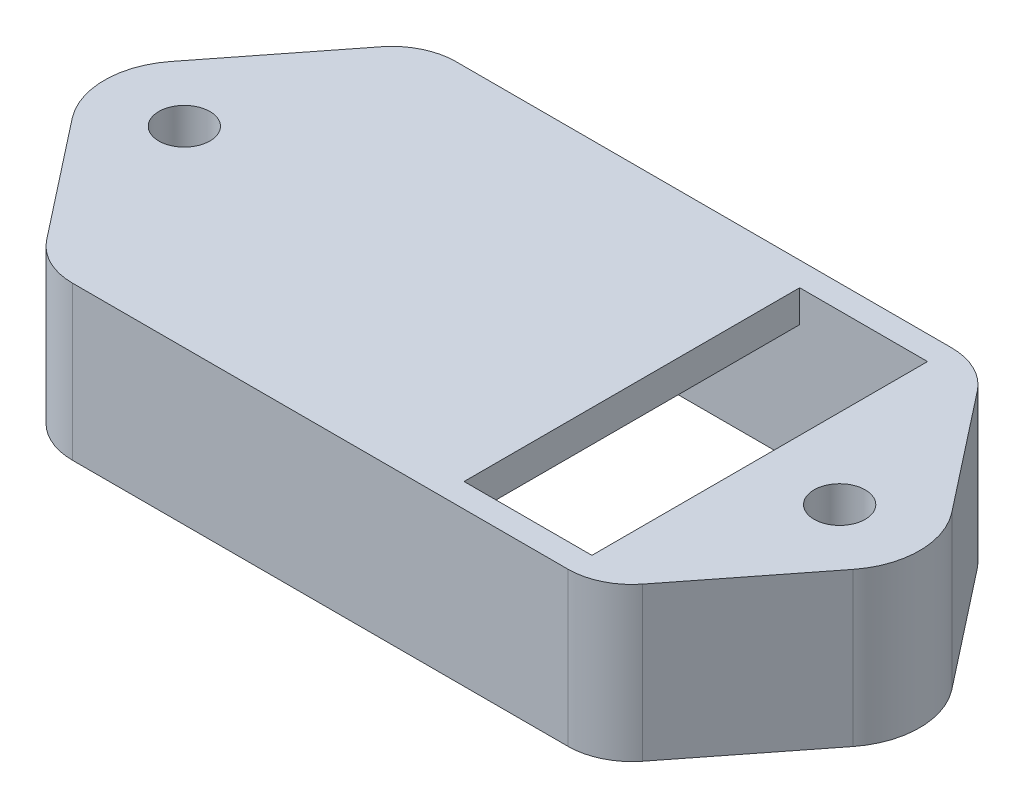
ISO-10303-21;
HEADER;
FILE_DESCRIPTION(('STEP AP214'),'2;1');
FILE_NAME('part.step','',(''),(''),'','','');
FILE_SCHEMA(('AUTOMOTIVE_DESIGN { 1 0 10303 214 1 1 1 1 }'));
ENDSEC;
DATA;
#1=APPLICATION_CONTEXT('core data for automotive mechanical design processes');
#2=APPLICATION_PROTOCOL_DEFINITION('international standard','automotive_design',2000,#1);
#3=PRODUCT_CONTEXT('',#1,'mechanical');
#4=PRODUCT('Part','Part','',(#3));
#5=PRODUCT_RELATED_PRODUCT_CATEGORY('part','',(#4));
#6=PRODUCT_DEFINITION_FORMATION('','',#4);
#7=PRODUCT_DEFINITION_CONTEXT('part definition',#1,'design');
#8=PRODUCT_DEFINITION('design','',#6,#7);
#9=PRODUCT_DEFINITION_SHAPE('','',#8);
#10=(LENGTH_UNIT() NAMED_UNIT(*) SI_UNIT(.MILLI.,.METRE.));
#11=(NAMED_UNIT(*) PLANE_ANGLE_UNIT() SI_UNIT($,.RADIAN.));
#12=(NAMED_UNIT(*) SI_UNIT($,.STERADIAN.) SOLID_ANGLE_UNIT());
#13=UNCERTAINTY_MEASURE_WITH_UNIT(LENGTH_MEASURE(1.E-05),#10,'distance_accuracy_value','');
#14=(GEOMETRIC_REPRESENTATION_CONTEXT(3) GLOBAL_UNCERTAINTY_ASSIGNED_CONTEXT((#13)) GLOBAL_UNIT_ASSIGNED_CONTEXT((#10,
#11,#12)) REPRESENTATION_CONTEXT('',''));
#15=CARTESIAN_POINT('',(0.,0.,0.));
#16=DIRECTION('',(0.,0.,1.));
#17=DIRECTION('',(1.,0.,0.));
#18=AXIS2_PLACEMENT_3D('',#15,#16,#17);
#19=CARTESIAN_POINT('',(-7.75,0.,-4.));
#20=DIRECTION('',(0.,1.,0.));
#21=DIRECTION('',(0.,0.,1.));
#22=AXIS2_PLACEMENT_3D('',#19,#20,#21);
#23=PLANE('',#22);
#24=CARTESIAN_POINT('',(-7.75,0.,-4.));
#25=DIRECTION('',(0.,1.,0.));
#26=DIRECTION('',(0.,0.,1.));
#27=AXIS2_PLACEMENT_3D('',#24,#25,#26);
#28=CIRCLE('',#27,2.);
#29=CARTESIAN_POINT('',(-7.75,0.,-6.));
#30=VERTEX_POINT('',#29);
#31=CARTESIAN_POINT('',(-9.32408207094775,0.,-5.23380129434234));
#32=VERTEX_POINT('',#31);
#33=EDGE_CURVE('E267',#30,#32,#28,.T.);
#34=ORIENTED_EDGE('',*,*,#33,.F.);
#35=DIRECTION('',(-1.,0.,0.));
#36=VECTOR('',#35,1.);
#37=CARTESIAN_POINT('',(-7.75,0.,-6.));
#38=LINE('',#37,#36);
#39=CARTESIAN_POINT('',(7.75,0.,-6.));
#40=VERTEX_POINT('',#39);
#41=EDGE_CURVE('E60',#40,#30,#38,.T.);
#42=ORIENTED_EDGE('',*,*,#41,.F.);
#43=CARTESIAN_POINT('',(7.75,0.,-4.));
#44=DIRECTION('',(0.,1.,0.));
#45=DIRECTION('',(0.,0.,-1.));
#46=AXIS2_PLACEMENT_3D('',#43,#44,#45);
#47=CIRCLE('',#46,2.);
#48=CARTESIAN_POINT('',(9.32408207094775,0.,-5.23380129434234));
#49=VERTEX_POINT('',#48);
#50=EDGE_CURVE('E288',#49,#40,#47,.T.);
#51=ORIENTED_EDGE('',*,*,#50,.F.);
#52=DIRECTION('',(-0.616900647171171,0.,-0.787041035473875));
#53=VECTOR('',#52,1.);
#54=CARTESIAN_POINT('',(9.32408207094775,0.,-5.23380129434234));
#55=LINE('',#54,#53);
#56=CARTESIAN_POINT('',(12.2176025886847,0.,-1.54225161792793));
#57=VERTEX_POINT('',#56);
#58=EDGE_CURVE('E286',#57,#49,#55,.T.);
#59=ORIENTED_EDGE('',*,*,#58,.F.);
#60=CARTESIAN_POINT('',(10.25,0.,0.));
#61=DIRECTION('',(0.,1.,0.));
#62=DIRECTION('',(0.,0.,-1.));
#63=AXIS2_PLACEMENT_3D('',#60,#61,#62);
#64=CIRCLE('',#63,2.49999999999999);
#65=CARTESIAN_POINT('',(12.2176025886847,0.,1.54225161792793));
#66=VERTEX_POINT('',#65);
#67=EDGE_CURVE('E284',#66,#57,#64,.T.);
#68=ORIENTED_EDGE('',*,*,#67,.F.);
#69=DIRECTION('',(0.616900647171171,0.,-0.787041035473875));
#70=VECTOR('',#69,1.);
#71=CARTESIAN_POINT('',(9.32408207094775,0.,5.23380129434234));
#72=LINE('',#71,#70);
#73=CARTESIAN_POINT('',(9.32408207094775,0.,5.23380129434234));
#74=VERTEX_POINT('',#73);
#75=EDGE_CURVE('E282',#74,#66,#72,.T.);
#76=ORIENTED_EDGE('',*,*,#75,.F.);
#77=CARTESIAN_POINT('',(7.75,0.,4.));
#78=DIRECTION('',(0.,1.,0.));
#79=DIRECTION('',(0.,0.,1.));
#80=AXIS2_PLACEMENT_3D('',#77,#78,#79);
#81=CIRCLE('',#80,2.);
#82=CARTESIAN_POINT('',(7.75,0.,6.));
#83=VERTEX_POINT('',#82);
#84=EDGE_CURVE('E280',#83,#74,#81,.T.);
#85=ORIENTED_EDGE('',*,*,#84,.F.);
#86=DIRECTION('',(1.,0.,0.));
#87=VECTOR('',#86,1.);
#88=CARTESIAN_POINT('',(-7.75,0.,6.));
#89=LINE('',#88,#87);
#90=CARTESIAN_POINT('',(-7.75,0.,6.));
#91=VERTEX_POINT('',#90);
#92=EDGE_CURVE('E278',#91,#83,#89,.T.);
#93=ORIENTED_EDGE('',*,*,#92,.F.);
#94=CARTESIAN_POINT('',(-7.75,0.,4.));
#95=DIRECTION('',(0.,1.,0.));
#96=DIRECTION('',(0.,0.,-1.));
#97=AXIS2_PLACEMENT_3D('',#94,#95,#96);
#98=CIRCLE('',#97,2.);
#99=CARTESIAN_POINT('',(-9.32408207094775,0.,5.23380129434234));
#100=VERTEX_POINT('',#99);
#101=EDGE_CURVE('E276',#100,#91,#98,.T.);
#102=ORIENTED_EDGE('',*,*,#101,.F.);
#103=DIRECTION('',(0.616900647171171,0.,0.787041035473875));
#104=VECTOR('',#103,1.);
#105=CARTESIAN_POINT('',(-9.32408207094775,0.,5.23380129434234));
#106=LINE('',#105,#104);
#107=CARTESIAN_POINT('',(-12.2176025886847,0.,1.54225161792793));
#108=VERTEX_POINT('',#107);
#109=EDGE_CURVE('E274',#108,#100,#106,.T.);
#110=ORIENTED_EDGE('',*,*,#109,.F.);
#111=CARTESIAN_POINT('',(-10.25,0.,0.));
#112=DIRECTION('',(0.,1.,0.));
#113=DIRECTION('',(0.,0.,1.));
#114=AXIS2_PLACEMENT_3D('',#111,#112,#113);
#115=CIRCLE('',#114,2.49999999999999);
#116=CARTESIAN_POINT('',(-12.2176025886847,0.,-1.54225161792793));
#117=VERTEX_POINT('',#116);
#118=EDGE_CURVE('E272',#117,#108,#115,.T.);
#119=ORIENTED_EDGE('',*,*,#118,.F.);
#120=DIRECTION('',(-0.616900647171171,0.,0.787041035473875));
#121=VECTOR('',#120,1.);
#122=CARTESIAN_POINT('',(-9.32408207094775,0.,-5.23380129434234));
#123=LINE('',#122,#121);
#124=EDGE_CURVE('E270',#32,#117,#123,.T.);
#125=ORIENTED_EDGE('',*,*,#124,.F.);
#126=EDGE_LOOP('',(#34,#42,#51,#59,#68,#76,#85,#93,#102,#110,#119,#125));
#127=FACE_BOUND('',#126,.T.);
#128=DIRECTION('',(0.,0.,1.));
#129=VECTOR('',#128,1.);
#130=CARTESIAN_POINT('',(-7.75,0.,5.25));
#131=LINE('',#130,#129);
#132=CARTESIAN_POINT('',(-7.75,0.,-5.25));
#133=VERTEX_POINT('',#132);
#134=CARTESIAN_POINT('',(-7.75,0.,5.25));
#135=VERTEX_POINT('',#134);
#136=EDGE_CURVE('E52',#133,#135,#131,.T.);
#137=ORIENTED_EDGE('',*,*,#136,.T.);
#138=DIRECTION('',(1.,0.,0.));
#139=VECTOR('',#138,1.);
#140=CARTESIAN_POINT('',(-7.75,0.,5.25));
#141=LINE('',#140,#139);
#142=CARTESIAN_POINT('',(7.75,0.,5.25));
#143=VERTEX_POINT('',#142);
#144=EDGE_CURVE('E252',#135,#143,#141,.T.);
#145=ORIENTED_EDGE('',*,*,#144,.T.);
#146=DIRECTION('',(0.,0.,-1.));
#147=VECTOR('',#146,1.);
#148=CARTESIAN_POINT('',(7.75,0.,5.25));
#149=LINE('',#148,#147);
#150=CARTESIAN_POINT('',(7.75,0.,-5.25));
#151=VERTEX_POINT('',#150);
#152=EDGE_CURVE('E255',#143,#151,#149,.T.);
#153=ORIENTED_EDGE('',*,*,#152,.T.);
#154=DIRECTION('',(-1.,0.,0.));
#155=VECTOR('',#154,1.);
#156=CARTESIAN_POINT('',(-7.75,0.,-5.25));
#157=LINE('',#156,#155);
#158=EDGE_CURVE('E245',#151,#133,#157,.T.);
#159=ORIENTED_EDGE('',*,*,#158,.T.);
#160=EDGE_LOOP('',(#137,#145,#153,#159));
#161=FACE_BOUND('',#160,.T.);
#162=CARTESIAN_POINT('',(-10.25,0.,0.));
#163=DIRECTION('',(0.,1.,0.));
#164=DIRECTION('',(0.,0.,-1.));
#165=AXIS2_PLACEMENT_3D('',#162,#163,#164);
#166=CIRCLE('',#165,0.800000000000001);
#167=CARTESIAN_POINT('',(-10.25,0.,-0.800000000000001));
#168=VERTEX_POINT('',#167);
#169=EDGE_CURVE('E239',#168,#168,#166,.T.);
#170=ORIENTED_EDGE('',*,*,#169,.T.);
#171=EDGE_LOOP('',(#170));
#172=FACE_BOUND('',#171,.T.);
#173=CARTESIAN_POINT('',(10.25,0.,0.));
#174=DIRECTION('',(0.,1.,0.));
#175=DIRECTION('',(0.,0.,1.));
#176=AXIS2_PLACEMENT_3D('',#173,#174,#175);
#177=CIRCLE('',#176,0.800000000000001);
#178=CARTESIAN_POINT('',(10.25,0.,0.800000000000001));
#179=VERTEX_POINT('',#178);
#180=EDGE_CURVE('E236',#179,#179,#177,.T.);
#181=ORIENTED_EDGE('',*,*,#180,.T.);
#182=EDGE_LOOP('',(#181));
#183=FACE_BOUND('',#182,.T.);
#184=ADVANCED_FACE('F37',(#127,#161,#172,#183),#23,.F.);
#185=CARTESIAN_POINT('',(-7.75,3.8,-4.));
#186=DIRECTION('',(0.,-1.,0.));
#187=DIRECTION('',(0.,0.,-1.));
#188=AXIS2_PLACEMENT_3D('',#185,#186,#187);
#189=CYLINDRICAL_SURFACE('',#188,2.);
#190=ORIENTED_EDGE('',*,*,#33,.T.);
#191=DIRECTION('',(0.,-1.,0.));
#192=VECTOR('',#191,1.);
#193=CARTESIAN_POINT('',(-9.32408207094775,3.8,-5.23380129434234));
#194=LINE('',#193,#192);
#195=CARTESIAN_POINT('',(-9.32408207094775,4.8,-5.23380129434234));
#196=VERTEX_POINT('',#195);
#197=EDGE_CURVE('E11',#196,#32,#194,.T.);
#198=ORIENTED_EDGE('',*,*,#197,.F.);
#199=CARTESIAN_POINT('',(-7.75,4.8,-4.));
#200=DIRECTION('',(0.,1.,0.));
#201=DIRECTION('',(0.,0.,1.));
#202=AXIS2_PLACEMENT_3D('',#199,#200,#201);
#203=CIRCLE('',#202,2.);
#204=CARTESIAN_POINT('',(-7.75,4.8,-6.));
#205=VERTEX_POINT('',#204);
#206=EDGE_CURVE('E186',#205,#196,#203,.T.);
#207=ORIENTED_EDGE('',*,*,#206,.F.);
#208=DIRECTION('',(0.,-1.,0.));
#209=VECTOR('',#208,1.);
#210=CARTESIAN_POINT('',(-7.75,3.8,-6.));
#211=LINE('',#210,#209);
#212=EDGE_CURVE('E291',#205,#30,#211,.T.);
#213=ORIENTED_EDGE('',*,*,#212,.T.);
#214=EDGE_LOOP('',(#190,#198,#207,#213));
#215=FACE_BOUND('',#214,.T.);
#216=ADVANCED_FACE('F39',(#215),#189,.T.);
#217=CARTESIAN_POINT('',(-9.32408207094775,3.8,-5.23380129434234));
#218=DIRECTION('',(0.787041035473875,0.,0.616900647171171));
#219=DIRECTION('',(0.616900647171171,0.,-0.787041035473875));
#220=AXIS2_PLACEMENT_3D('',#217,#218,#219);
#221=PLANE('',#220);
#222=ORIENTED_EDGE('',*,*,#124,.T.);
#223=DIRECTION('',(0.,-1.,0.));
#224=VECTOR('',#223,1.);
#225=CARTESIAN_POINT('',(-12.2176025886847,3.8,-1.54225161792793));
#226=LINE('',#225,#224);
#227=CARTESIAN_POINT('',(-12.2176025886847,4.8,-1.54225161792793));
#228=VERTEX_POINT('',#227);
#229=EDGE_CURVE('E45',#228,#117,#226,.T.);
#230=ORIENTED_EDGE('',*,*,#229,.F.);
#231=DIRECTION('',(-0.616900647171171,0.,0.787041035473876));
#232=VECTOR('',#231,1.);
#233=CARTESIAN_POINT('',(-9.32408207094775,4.8,-5.23380129434234));
#234=LINE('',#233,#232);
#235=EDGE_CURVE('E203',#196,#228,#234,.T.);
#236=ORIENTED_EDGE('',*,*,#235,.F.);
#237=ORIENTED_EDGE('',*,*,#197,.T.);
#238=EDGE_LOOP('',(#222,#230,#236,#237));
#239=FACE_BOUND('',#238,.T.);
#240=ADVANCED_FACE('F365',(#239),#221,.F.);
#241=CARTESIAN_POINT('',(-10.25,3.8,0.));
#242=DIRECTION('',(0.,-1.,0.));
#243=DIRECTION('',(0.,0.,-1.));
#244=AXIS2_PLACEMENT_3D('',#241,#242,#243);
#245=CYLINDRICAL_SURFACE('',#244,2.49999999999999);
#246=ORIENTED_EDGE('',*,*,#118,.T.);
#247=DIRECTION('',(0.,-1.,0.));
#248=VECTOR('',#247,1.);
#249=CARTESIAN_POINT('',(-12.2176025886847,3.8,1.54225161792793));
#250=LINE('',#249,#248);
#251=CARTESIAN_POINT('',(-12.2176025886847,4.8,1.54225161792793));
#252=VERTEX_POINT('',#251);
#253=EDGE_CURVE('E316',#252,#108,#250,.T.);
#254=ORIENTED_EDGE('',*,*,#253,.F.);
#255=CARTESIAN_POINT('',(-10.25,4.8,0.));
#256=DIRECTION('',(0.,1.,0.));
#257=DIRECTION('',(0.,0.,1.));
#258=AXIS2_PLACEMENT_3D('',#255,#256,#257);
#259=CIRCLE('',#258,2.5);
#260=EDGE_CURVE('E206',#228,#252,#259,.T.);
#261=ORIENTED_EDGE('',*,*,#260,.F.);
#262=ORIENTED_EDGE('',*,*,#229,.T.);
#263=EDGE_LOOP('',(#246,#254,#261,#262));
#264=FACE_BOUND('',#263,.T.);
#265=ADVANCED_FACE('F322',(#264),#245,.T.);
#266=CARTESIAN_POINT('',(-9.32408207094775,3.8,5.23380129434234));
#267=DIRECTION('',(0.787041035473875,0.,-0.616900647171171));
#268=DIRECTION('',(-0.616900647171171,0.,-0.787041035473875));
#269=AXIS2_PLACEMENT_3D('',#266,#267,#268);
#270=PLANE('',#269);
#271=ORIENTED_EDGE('',*,*,#109,.T.);
#272=DIRECTION('',(0.,-1.,0.));
#273=VECTOR('',#272,1.);
#274=CARTESIAN_POINT('',(-9.32408207094775,3.8,5.23380129434234));
#275=LINE('',#274,#273);
#276=CARTESIAN_POINT('',(-9.32408207094775,4.8,5.23380129434234));
#277=VERTEX_POINT('',#276);
#278=EDGE_CURVE('E313',#277,#100,#275,.T.);
#279=ORIENTED_EDGE('',*,*,#278,.F.);
#280=DIRECTION('',(0.616900647171171,0.,0.787041035473876));
#281=VECTOR('',#280,1.);
#282=CARTESIAN_POINT('',(-12.2176025886847,4.8,1.54225161792793));
#283=LINE('',#282,#281);
#284=EDGE_CURVE('E209',#252,#277,#283,.T.);
#285=ORIENTED_EDGE('',*,*,#284,.F.);
#286=ORIENTED_EDGE('',*,*,#253,.T.);
#287=EDGE_LOOP('',(#271,#279,#285,#286));
#288=FACE_BOUND('',#287,.T.);
#289=ADVANCED_FACE('F332',(#288),#270,.F.);
#290=CARTESIAN_POINT('',(-7.75,3.8,4.));
#291=DIRECTION('',(0.,-1.,0.));
#292=DIRECTION('',(0.,0.,-1.));
#293=AXIS2_PLACEMENT_3D('',#290,#291,#292);
#294=CYLINDRICAL_SURFACE('',#293,2.);
#295=ORIENTED_EDGE('',*,*,#101,.T.);
#296=DIRECTION('',(0.,-1.,0.));
#297=VECTOR('',#296,1.);
#298=CARTESIAN_POINT('',(-7.75,3.8,6.));
#299=LINE('',#298,#297);
#300=CARTESIAN_POINT('',(-7.75,4.8,6.));
#301=VERTEX_POINT('',#300);
#302=EDGE_CURVE('E310',#301,#91,#299,.T.);
#303=ORIENTED_EDGE('',*,*,#302,.F.);
#304=CARTESIAN_POINT('',(-7.75,4.8,4.));
#305=DIRECTION('',(0.,1.,0.));
#306=DIRECTION('',(0.,0.,1.));
#307=AXIS2_PLACEMENT_3D('',#304,#305,#306);
#308=CIRCLE('',#307,2.);
#309=EDGE_CURVE('E212',#277,#301,#308,.T.);
#310=ORIENTED_EDGE('',*,*,#309,.F.);
#311=ORIENTED_EDGE('',*,*,#278,.T.);
#312=EDGE_LOOP('',(#295,#303,#310,#311));
#313=FACE_BOUND('',#312,.T.);
#314=ADVANCED_FACE('F336',(#313),#294,.T.);
#315=CARTESIAN_POINT('',(-7.75,3.8,6.));
#316=DIRECTION('',(0.,0.,-1.));
#317=DIRECTION('',(-1.,0.,0.));
#318=AXIS2_PLACEMENT_3D('',#315,#316,#317);
#319=PLANE('',#318);
#320=ORIENTED_EDGE('',*,*,#92,.T.);
#321=DIRECTION('',(0.,-1.,0.));
#322=VECTOR('',#321,1.);
#323=CARTESIAN_POINT('',(7.75,3.8,6.));
#324=LINE('',#323,#322);
#325=CARTESIAN_POINT('',(7.75,4.8,6.));
#326=VERTEX_POINT('',#325);
#327=EDGE_CURVE('E307',#326,#83,#324,.T.);
#328=ORIENTED_EDGE('',*,*,#327,.F.);
#329=DIRECTION('',(1.,0.,0.));
#330=VECTOR('',#329,1.);
#331=CARTESIAN_POINT('',(-7.75,4.8,6.));
#332=LINE('',#331,#330);
#333=EDGE_CURVE('E215',#301,#326,#332,.T.);
#334=ORIENTED_EDGE('',*,*,#333,.F.);
#335=ORIENTED_EDGE('',*,*,#302,.T.);
#336=EDGE_LOOP('',(#320,#328,#334,#335));
#337=FACE_BOUND('',#336,.T.);
#338=ADVANCED_FACE('F341',(#337),#319,.F.);
#339=CARTESIAN_POINT('',(7.75,3.8,4.));
#340=DIRECTION('',(0.,-1.,0.));
#341=DIRECTION('',(0.,0.,-1.));
#342=AXIS2_PLACEMENT_3D('',#339,#340,#341);
#343=CYLINDRICAL_SURFACE('',#342,2.);
#344=ORIENTED_EDGE('',*,*,#84,.T.);
#345=DIRECTION('',(0.,-1.,0.));
#346=VECTOR('',#345,1.);
#347=CARTESIAN_POINT('',(9.32408207094775,3.8,5.23380129434234));
#348=LINE('',#347,#346);
#349=CARTESIAN_POINT('',(9.32408207094775,4.8,5.23380129434234));
#350=VERTEX_POINT('',#349);
#351=EDGE_CURVE('E304',#350,#74,#348,.T.);
#352=ORIENTED_EDGE('',*,*,#351,.F.);
#353=CARTESIAN_POINT('',(7.75,4.8,4.));
#354=DIRECTION('',(0.,1.,0.));
#355=DIRECTION('',(0.,0.,1.));
#356=AXIS2_PLACEMENT_3D('',#353,#354,#355);
#357=CIRCLE('',#356,2.);
#358=EDGE_CURVE('E218',#326,#350,#357,.T.);
#359=ORIENTED_EDGE('',*,*,#358,.F.);
#360=ORIENTED_EDGE('',*,*,#327,.T.);
#361=EDGE_LOOP('',(#344,#352,#359,#360));
#362=FACE_BOUND('',#361,.T.);
#363=ADVANCED_FACE('F344',(#362),#343,.T.);
#364=CARTESIAN_POINT('',(9.32408207094775,3.8,5.23380129434234));
#365=DIRECTION('',(-0.787041035473875,0.,-0.616900647171171));
#366=DIRECTION('',(-0.616900647171171,0.,0.787041035473875));
#367=AXIS2_PLACEMENT_3D('',#364,#365,#366);
#368=PLANE('',#367);
#369=ORIENTED_EDGE('',*,*,#75,.T.);
#370=DIRECTION('',(0.,-1.,0.));
#371=VECTOR('',#370,1.);
#372=CARTESIAN_POINT('',(12.2176025886847,3.8,1.54225161792793));
#373=LINE('',#372,#371);
#374=CARTESIAN_POINT('',(12.2176025886847,4.8,1.54225161792793));
#375=VERTEX_POINT('',#374);
#376=EDGE_CURVE('E301',#375,#66,#373,.T.);
#377=ORIENTED_EDGE('',*,*,#376,.F.);
#378=DIRECTION('',(0.616900647171171,0.,-0.787041035473875));
#379=VECTOR('',#378,1.);
#380=CARTESIAN_POINT('',(9.32408207094775,4.8,5.23380129434234));
#381=LINE('',#380,#379);
#382=EDGE_CURVE('E221',#350,#375,#381,.T.);
#383=ORIENTED_EDGE('',*,*,#382,.F.);
#384=ORIENTED_EDGE('',*,*,#351,.T.);
#385=EDGE_LOOP('',(#369,#377,#383,#384));
#386=FACE_BOUND('',#385,.T.);
#387=ADVANCED_FACE('F349',(#386),#368,.F.);
#388=CARTESIAN_POINT('',(10.25,3.8,0.));
#389=DIRECTION('',(0.,-1.,0.));
#390=DIRECTION('',(0.,0.,-1.));
#391=AXIS2_PLACEMENT_3D('',#388,#389,#390);
#392=CYLINDRICAL_SURFACE('',#391,2.49999999999999);
#393=ORIENTED_EDGE('',*,*,#67,.T.);
#394=DIRECTION('',(0.,-1.,0.));
#395=VECTOR('',#394,1.);
#396=CARTESIAN_POINT('',(12.2176025886847,3.8,-1.54225161792793));
#397=LINE('',#396,#395);
#398=CARTESIAN_POINT('',(12.2176025886847,4.8,-1.54225161792793));
#399=VERTEX_POINT('',#398);
#400=EDGE_CURVE('E298',#399,#57,#397,.T.);
#401=ORIENTED_EDGE('',*,*,#400,.F.);
#402=CARTESIAN_POINT('',(10.25,4.8,0.));
#403=DIRECTION('',(0.,1.,0.));
#404=DIRECTION('',(0.,0.,1.));
#405=AXIS2_PLACEMENT_3D('',#402,#403,#404);
#406=CIRCLE('',#405,2.49999999999999);
#407=EDGE_CURVE('E224',#375,#399,#406,.T.);
#408=ORIENTED_EDGE('',*,*,#407,.F.);
#409=ORIENTED_EDGE('',*,*,#376,.T.);
#410=EDGE_LOOP('',(#393,#401,#408,#409));
#411=FACE_BOUND('',#410,.T.);
#412=ADVANCED_FACE('F353',(#411),#392,.T.);
#413=CARTESIAN_POINT('',(9.32408207094775,3.8,-5.23380129434234));
#414=DIRECTION('',(-0.787041035473875,0.,0.616900647171171));
#415=DIRECTION('',(0.616900647171171,0.,0.787041035473875));
#416=AXIS2_PLACEMENT_3D('',#413,#414,#415);
#417=PLANE('',#416);
#418=ORIENTED_EDGE('',*,*,#58,.T.);
#419=DIRECTION('',(0.,-1.,0.));
#420=VECTOR('',#419,1.);
#421=CARTESIAN_POINT('',(9.32408207094775,3.8,-5.23380129434234));
#422=LINE('',#421,#420);
#423=CARTESIAN_POINT('',(9.32408207094775,4.8,-5.23380129434234));
#424=VERTEX_POINT('',#423);
#425=EDGE_CURVE('E295',#424,#49,#422,.T.);
#426=ORIENTED_EDGE('',*,*,#425,.F.);
#427=DIRECTION('',(-0.616900647171171,0.,-0.787041035473876));
#428=VECTOR('',#427,1.);
#429=CARTESIAN_POINT('',(12.2176025886847,4.8,-1.54225161792793));
#430=LINE('',#429,#428);
#431=EDGE_CURVE('E227',#399,#424,#430,.T.);
#432=ORIENTED_EDGE('',*,*,#431,.F.);
#433=ORIENTED_EDGE('',*,*,#400,.T.);
#434=EDGE_LOOP('',(#418,#426,#432,#433));
#435=FACE_BOUND('',#434,.T.);
#436=ADVANCED_FACE('F357',(#435),#417,.F.);
#437=CARTESIAN_POINT('',(7.75,3.8,-4.));
#438=DIRECTION('',(0.,-1.,0.));
#439=DIRECTION('',(0.,0.,-1.));
#440=AXIS2_PLACEMENT_3D('',#437,#438,#439);
#441=CYLINDRICAL_SURFACE('',#440,2.);
#442=ORIENTED_EDGE('',*,*,#50,.T.);
#443=DIRECTION('',(0.,-1.,0.));
#444=VECTOR('',#443,1.);
#445=CARTESIAN_POINT('',(7.75,3.8,-6.));
#446=LINE('',#445,#444);
#447=CARTESIAN_POINT('',(7.75,4.8,-6.));
#448=VERTEX_POINT('',#447);
#449=EDGE_CURVE('E293',#448,#40,#446,.T.);
#450=ORIENTED_EDGE('',*,*,#449,.F.);
#451=CARTESIAN_POINT('',(7.75,4.8,-4.));
#452=DIRECTION('',(0.,1.,0.));
#453=DIRECTION('',(0.,0.,1.));
#454=AXIS2_PLACEMENT_3D('',#451,#452,#453);
#455=CIRCLE('',#454,2.);
#456=EDGE_CURVE('E230',#424,#448,#455,.T.);
#457=ORIENTED_EDGE('',*,*,#456,.F.);
#458=ORIENTED_EDGE('',*,*,#425,.T.);
#459=EDGE_LOOP('',(#442,#450,#457,#458));
#460=FACE_BOUND('',#459,.T.);
#461=ADVANCED_FACE('F360',(#460),#441,.T.);
#462=CARTESIAN_POINT('',(-7.75,3.8,-6.));
#463=DIRECTION('',(0.,0.,1.));
#464=DIRECTION('',(1.,0.,0.));
#465=AXIS2_PLACEMENT_3D('',#462,#463,#464);
#466=PLANE('',#465);
#467=ORIENTED_EDGE('',*,*,#41,.T.);
#468=ORIENTED_EDGE('',*,*,#212,.F.);
#469=DIRECTION('',(-1.,0.,0.));
#470=VECTOR('',#469,1.);
#471=CARTESIAN_POINT('',(7.75,4.8,-6.));
#472=LINE('',#471,#470);
#473=EDGE_CURVE('E233',#448,#205,#472,.T.);
#474=ORIENTED_EDGE('',*,*,#473,.F.);
#475=ORIENTED_EDGE('',*,*,#449,.T.);
#476=EDGE_LOOP('',(#467,#468,#474,#475));
#477=FACE_BOUND('',#476,.T.);
#478=ADVANCED_FACE('F364',(#477),#466,.F.);
#479=CARTESIAN_POINT('',(-7.75,3.8,5.25));
#480=DIRECTION('',(1.,0.,0.));
#481=DIRECTION('',(0.,0.,-1.));
#482=AXIS2_PLACEMENT_3D('',#479,#480,#481);
#483=PLANE('',#482);
#484=ORIENTED_EDGE('',*,*,#136,.F.);
#485=DIRECTION('',(0.,-1.,0.));
#486=VECTOR('',#485,1.);
#487=CARTESIAN_POINT('',(-7.75,3.8,-5.25));
#488=LINE('',#487,#486);
#489=CARTESIAN_POINT('',(-7.75,3.8,-5.25));
#490=VERTEX_POINT('',#489);
#491=EDGE_CURVE('E250',#490,#133,#488,.T.);
#492=ORIENTED_EDGE('',*,*,#491,.F.);
#493=DIRECTION('',(0.,0.,1.));
#494=VECTOR('',#493,1.);
#495=CARTESIAN_POINT('',(-7.75,3.8,5.25));
#496=LINE('',#495,#494);
#497=CARTESIAN_POINT('',(-7.75,3.8,5.25));
#498=VERTEX_POINT('',#497);
#499=EDGE_CURVE('E242',#490,#498,#496,.T.);
#500=ORIENTED_EDGE('',*,*,#499,.T.);
#501=DIRECTION('',(0.,-1.,0.));
#502=VECTOR('',#501,1.);
#503=CARTESIAN_POINT('',(-7.75,3.8,5.25));
#504=LINE('',#503,#502);
#505=EDGE_CURVE('E265',#498,#135,#504,.T.);
#506=ORIENTED_EDGE('',*,*,#505,.T.);
#507=EDGE_LOOP('',(#484,#492,#500,#506));
#508=FACE_BOUND('',#507,.T.);
#509=ADVANCED_FACE('F378',(#508),#483,.T.);
#510=CARTESIAN_POINT('',(-7.75,3.8,5.25));
#511=DIRECTION('',(0.,0.,-1.));
#512=DIRECTION('',(-1.,0.,0.));
#513=AXIS2_PLACEMENT_3D('',#510,#511,#512);
#514=PLANE('',#513);
#515=ORIENTED_EDGE('',*,*,#144,.F.);
#516=ORIENTED_EDGE('',*,*,#505,.F.);
#517=DIRECTION('',(1.,0.,0.));
#518=VECTOR('',#517,1.);
#519=CARTESIAN_POINT('',(-7.75,3.8,5.25));
#520=LINE('',#519,#518);
#521=CARTESIAN_POINT('',(3.75,3.8,5.25));
#522=VERTEX_POINT('',#521);
#523=EDGE_CURVE('E185',#498,#522,#520,.T.);
#524=ORIENTED_EDGE('',*,*,#523,.T.);
#525=DIRECTION('',(0.,-1.,0.));
#526=VECTOR('',#525,1.);
#527=CARTESIAN_POINT('',(3.75,4.8,5.25));
#528=LINE('',#527,#526);
#529=CARTESIAN_POINT('',(3.75,4.8,5.25));
#530=VERTEX_POINT('',#529);
#531=EDGE_CURVE('E169',#530,#522,#528,.T.);
#532=ORIENTED_EDGE('',*,*,#531,.F.);
#533=DIRECTION('',(1.,0.,0.));
#534=VECTOR('',#533,1.);
#535=CARTESIAN_POINT('',(3.75,4.8,5.25));
#536=LINE('',#535,#534);
#537=CARTESIAN_POINT('',(7.75,4.8,5.25));
#538=VERTEX_POINT('',#537);
#539=EDGE_CURVE('E176',#530,#538,#536,.T.);
#540=ORIENTED_EDGE('',*,*,#539,.T.);
#541=DIRECTION('',(0.,-1.,0.));
#542=VECTOR('',#541,1.);
#543=CARTESIAN_POINT('',(7.75,3.8,5.25));
#544=LINE('',#543,#542);
#545=EDGE_CURVE('E263',#538,#143,#544,.T.);
#546=ORIENTED_EDGE('',*,*,#545,.T.);
#547=EDGE_LOOP('',(#515,#516,#524,#532,#540,#546));
#548=FACE_BOUND('',#547,.T.);
#549=ADVANCED_FACE('F182',(#548),#514,.T.);
#550=CARTESIAN_POINT('',(7.75,3.8,5.25));
#551=DIRECTION('',(-1.,0.,0.));
#552=DIRECTION('',(0.,0.,1.));
#553=AXIS2_PLACEMENT_3D('',#550,#551,#552);
#554=PLANE('',#553);
#555=ORIENTED_EDGE('',*,*,#152,.F.);
#556=ORIENTED_EDGE('',*,*,#545,.F.);
#557=DIRECTION('',(0.,0.,-1.));
#558=VECTOR('',#557,1.);
#559=CARTESIAN_POINT('',(7.75,4.8,5.25));
#560=LINE('',#559,#558);
#561=CARTESIAN_POINT('',(7.75,4.8,-5.25));
#562=VERTEX_POINT('',#561);
#563=EDGE_CURVE('E191',#538,#562,#560,.T.);
#564=ORIENTED_EDGE('',*,*,#563,.T.);
#565=DIRECTION('',(0.,-1.,0.));
#566=VECTOR('',#565,1.);
#567=CARTESIAN_POINT('',(7.75,3.8,-5.25));
#568=LINE('',#567,#566);
#569=EDGE_CURVE('E261',#562,#151,#568,.T.);
#570=ORIENTED_EDGE('',*,*,#569,.T.);
#571=EDGE_LOOP('',(#555,#556,#564,#570));
#572=FACE_BOUND('',#571,.T.);
#573=ADVANCED_FACE('F444',(#572),#554,.T.);
#574=CARTESIAN_POINT('',(-7.75,3.8,-5.25));
#575=DIRECTION('',(0.,0.,1.));
#576=DIRECTION('',(1.,0.,0.));
#577=AXIS2_PLACEMENT_3D('',#574,#575,#576);
#578=PLANE('',#577);
#579=ORIENTED_EDGE('',*,*,#158,.F.);
#580=ORIENTED_EDGE('',*,*,#569,.F.);
#581=DIRECTION('',(-1.,0.,0.));
#582=VECTOR('',#581,1.);
#583=CARTESIAN_POINT('',(3.75,4.8,-5.25));
#584=LINE('',#583,#582);
#585=CARTESIAN_POINT('',(3.75,4.8,-5.25));
#586=VERTEX_POINT('',#585);
#587=EDGE_CURVE('E193',#562,#586,#584,.T.);
#588=ORIENTED_EDGE('',*,*,#587,.T.);
#589=DIRECTION('',(0.,-1.,0.));
#590=VECTOR('',#589,1.);
#591=CARTESIAN_POINT('',(3.75,4.8,-5.25));
#592=LINE('',#591,#590);
#593=CARTESIAN_POINT('',(3.75,3.8,-5.25));
#594=VERTEX_POINT('',#593);
#595=EDGE_CURVE('E172',#586,#594,#592,.T.);
#596=ORIENTED_EDGE('',*,*,#595,.T.);
#597=DIRECTION('',(-1.,0.,0.));
#598=VECTOR('',#597,1.);
#599=CARTESIAN_POINT('',(-7.75,3.8,-5.25));
#600=LINE('',#599,#598);
#601=EDGE_CURVE('E247',#594,#490,#600,.T.);
#602=ORIENTED_EDGE('',*,*,#601,.T.);
#603=ORIENTED_EDGE('',*,*,#491,.T.);
#604=EDGE_LOOP('',(#579,#580,#588,#596,#602,#603));
#605=FACE_BOUND('',#604,.T.);
#606=ADVANCED_FACE('F450',(#605),#578,.T.);
#607=CARTESIAN_POINT('',(-10.25,3.8,0.));
#608=DIRECTION('',(0.,-1.,0.));
#609=DIRECTION('',(0.,0.,-1.));
#610=AXIS2_PLACEMENT_3D('',#607,#608,#609);
#611=CYLINDRICAL_SURFACE('',#610,0.800000000000001);
#612=ORIENTED_EDGE('',*,*,#169,.F.);
#613=EDGE_LOOP('',(#612));
#614=FACE_BOUND('',#613,.T.);
#615=CARTESIAN_POINT('',(-10.25,4.8,0.));
#616=DIRECTION('',(0.,1.,0.));
#617=DIRECTION('',(0.,0.,1.));
#618=AXIS2_PLACEMENT_3D('',#615,#616,#617);
#619=CIRCLE('',#618,0.800000000000001);
#620=CARTESIAN_POINT('',(-10.25,4.8,0.800000000000001));
#621=VERTEX_POINT('',#620);
#622=EDGE_CURVE('E612',#621,#621,#619,.T.);
#623=ORIENTED_EDGE('',*,*,#622,.T.);
#624=EDGE_LOOP('',(#623));
#625=FACE_BOUND('',#624,.T.);
#626=ADVANCED_FACE('F458',(#614,#625),#611,.F.);
#627=CARTESIAN_POINT('',(10.25,3.8,0.));
#628=DIRECTION('',(0.,-1.,0.));
#629=DIRECTION('',(0.,0.,-1.));
#630=AXIS2_PLACEMENT_3D('',#627,#628,#629);
#631=CYLINDRICAL_SURFACE('',#630,0.800000000000001);
#632=ORIENTED_EDGE('',*,*,#180,.F.);
#633=EDGE_LOOP('',(#632));
#634=FACE_BOUND('',#633,.T.);
#635=CARTESIAN_POINT('',(10.25,4.8,0.));
#636=DIRECTION('',(0.,1.,0.));
#637=DIRECTION('',(0.,0.,1.));
#638=AXIS2_PLACEMENT_3D('',#635,#636,#637);
#639=CIRCLE('',#638,0.800000000000001);
#640=CARTESIAN_POINT('',(10.25,4.8,0.800000000000001));
#641=VERTEX_POINT('',#640);
#642=EDGE_CURVE('E199',#641,#641,#639,.T.);
#643=ORIENTED_EDGE('',*,*,#642,.T.);
#644=EDGE_LOOP('',(#643));
#645=FACE_BOUND('',#644,.T.);
#646=ADVANCED_FACE('F466',(#634,#645),#631,.F.);
#647=CARTESIAN_POINT('',(-7.75,4.8,-4.));
#648=DIRECTION('',(0.,1.,0.));
#649=DIRECTION('',(0.,0.,1.));
#650=AXIS2_PLACEMENT_3D('',#647,#648,#649);
#651=PLANE('',#650);
#652=ORIENTED_EDGE('',*,*,#642,.F.);
#653=EDGE_LOOP('',(#652));
#654=FACE_BOUND('',#653,.T.);
#655=ORIENTED_EDGE('',*,*,#206,.T.);
#656=ORIENTED_EDGE('',*,*,#235,.T.);
#657=ORIENTED_EDGE('',*,*,#260,.T.);
#658=ORIENTED_EDGE('',*,*,#284,.T.);
#659=ORIENTED_EDGE('',*,*,#309,.T.);
#660=ORIENTED_EDGE('',*,*,#333,.T.);
#661=ORIENTED_EDGE('',*,*,#358,.T.);
#662=ORIENTED_EDGE('',*,*,#382,.T.);
#663=ORIENTED_EDGE('',*,*,#407,.T.);
#664=ORIENTED_EDGE('',*,*,#431,.T.);
#665=ORIENTED_EDGE('',*,*,#456,.T.);
#666=ORIENTED_EDGE('',*,*,#473,.T.);
#667=EDGE_LOOP('',(#655,#656,#657,#658,#659,#660,#661,#662,#663,#664,#665,#666));
#668=FACE_BOUND('',#667,.T.);
#669=ORIENTED_EDGE('',*,*,#539,.F.);
#670=DIRECTION('',(0.,0.,1.));
#671=VECTOR('',#670,1.);
#672=CARTESIAN_POINT('',(3.75,4.8,5.25));
#673=LINE('',#672,#671);
#674=EDGE_CURVE('E165',#586,#530,#673,.T.);
#675=ORIENTED_EDGE('',*,*,#674,.F.);
#676=ORIENTED_EDGE('',*,*,#587,.F.);
#677=ORIENTED_EDGE('',*,*,#563,.F.);
#678=EDGE_LOOP('',(#669,#675,#676,#677));
#679=FACE_BOUND('',#678,.T.);
#680=ORIENTED_EDGE('',*,*,#622,.F.);
#681=EDGE_LOOP('',(#680));
#682=FACE_BOUND('',#681,.T.);
#683=ADVANCED_FACE('F188',(#654,#668,#679,#682),#651,.T.);
#684=CARTESIAN_POINT('',(-7.75,3.8,-4.));
#685=DIRECTION('',(0.,1.,0.));
#686=DIRECTION('',(0.,0.,1.));
#687=AXIS2_PLACEMENT_3D('',#684,#685,#686);
#688=PLANE('',#687);
#689=ORIENTED_EDGE('',*,*,#523,.F.);
#690=ORIENTED_EDGE('',*,*,#499,.F.);
#691=ORIENTED_EDGE('',*,*,#601,.F.);
#692=DIRECTION('',(0.,0.,1.));
#693=VECTOR('',#692,1.);
#694=CARTESIAN_POINT('',(3.75,3.8,5.25));
#695=LINE('',#694,#693);
#696=EDGE_CURVE('E177',#594,#522,#695,.T.);
#697=ORIENTED_EDGE('',*,*,#696,.T.);
#698=EDGE_LOOP('',(#689,#690,#691,#697));
#699=FACE_BOUND('',#698,.T.);
#700=ADVANCED_FACE('F481',(#699),#688,.F.);
#701=CARTESIAN_POINT('',(3.75,4.8,5.25));
#702=DIRECTION('',(1.,0.,0.));
#703=DIRECTION('',(0.,0.,-1.));
#704=AXIS2_PLACEMENT_3D('',#701,#702,#703);
#705=PLANE('',#704);
#706=ORIENTED_EDGE('',*,*,#696,.F.);
#707=ORIENTED_EDGE('',*,*,#595,.F.);
#708=ORIENTED_EDGE('',*,*,#674,.T.);
#709=ORIENTED_EDGE('',*,*,#531,.T.);
#710=EDGE_LOOP('',(#706,#707,#708,#709));
#711=FACE_BOUND('',#710,.T.);
#712=ADVANCED_FACE('F168',(#711),#705,.T.);
#713=CLOSED_SHELL('',(#184,#216,#240,#265,#289,#314,#338,#363,#387,#412,#436,#461,#478,#509,
#549,#573,#606,#626,#646,#683,#700,#712));
#714=MANIFOLD_SOLID_BREP('B2',#713);
#715=ADVANCED_BREP_SHAPE_REPRESENTATION('',(#18,#714),#14);
#716=SHAPE_DEFINITION_REPRESENTATION(#9,#715);
ENDSEC;
END-ISO-10303-21;
